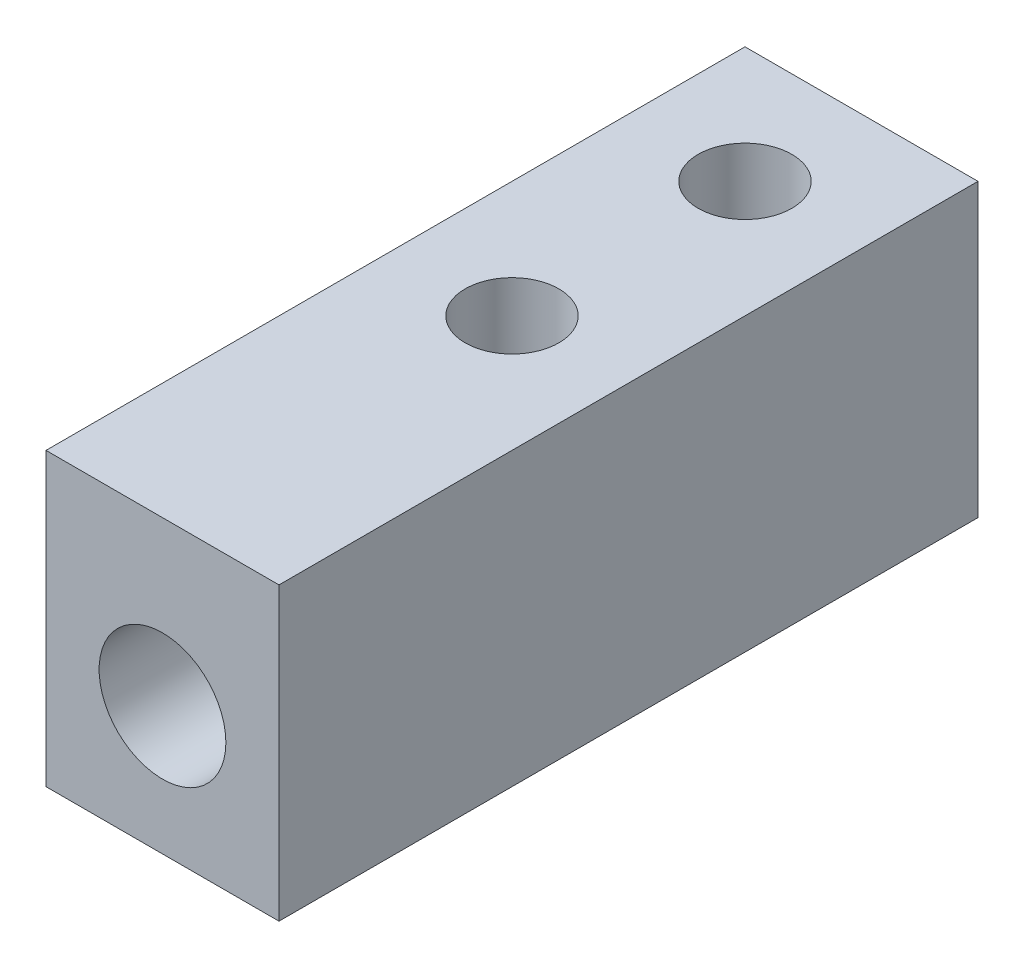
ISO-10303-21;
HEADER;
FILE_DESCRIPTION(('STEP AP214'),'2;1');
FILE_NAME('part.step','',(''),(''),'','','');
FILE_SCHEMA(('AUTOMOTIVE_DESIGN { 1 0 10303 214 1 1 1 1 }'));
ENDSEC;
DATA;
#1=APPLICATION_CONTEXT('core data for automotive mechanical design processes');
#2=APPLICATION_PROTOCOL_DEFINITION('international standard','automotive_design',2000,#1);
#3=PRODUCT_CONTEXT('',#1,'mechanical');
#4=PRODUCT('Part','Part','',(#3));
#5=PRODUCT_RELATED_PRODUCT_CATEGORY('part','',(#4));
#6=PRODUCT_DEFINITION_FORMATION('','',#4);
#7=PRODUCT_DEFINITION_CONTEXT('part definition',#1,'design');
#8=PRODUCT_DEFINITION('design','',#6,#7);
#9=PRODUCT_DEFINITION_SHAPE('','',#8);
#10=(LENGTH_UNIT() NAMED_UNIT(*) SI_UNIT(.MILLI.,.METRE.));
#11=(NAMED_UNIT(*) PLANE_ANGLE_UNIT() SI_UNIT($,.RADIAN.));
#12=(NAMED_UNIT(*) SI_UNIT($,.STERADIAN.) SOLID_ANGLE_UNIT());
#13=UNCERTAINTY_MEASURE_WITH_UNIT(LENGTH_MEASURE(1.E-05),#10,'distance_accuracy_value','');
#14=(GEOMETRIC_REPRESENTATION_CONTEXT(3) GLOBAL_UNCERTAINTY_ASSIGNED_CONTEXT((#13)) GLOBAL_UNIT_ASSIGNED_CONTEXT((#10,
#11,#12)) REPRESENTATION_CONTEXT('',''));
#15=CARTESIAN_POINT('',(0.,0.,0.));
#16=DIRECTION('',(0.,0.,1.));
#17=DIRECTION('',(1.,0.,0.));
#18=AXIS2_PLACEMENT_3D('',#15,#16,#17);
#19=CARTESIAN_POINT('',(6.35,-6.35,15.875));
#20=DIRECTION('',(-1.,0.,0.));
#21=DIRECTION('',(0.,0.,1.));
#22=AXIS2_PLACEMENT_3D('',#19,#20,#21);
#23=PLANE('',#22);
#24=DIRECTION('',(0.,1.,0.));
#25=VECTOR('',#24,1.);
#26=CARTESIAN_POINT('',(6.35,-6.35,-15.875));
#27=LINE('',#26,#25);
#28=CARTESIAN_POINT('',(6.35,-9.525,-15.875));
#29=VERTEX_POINT('',#28);
#30=CARTESIAN_POINT('',(6.35,6.35,-15.875));
#31=VERTEX_POINT('',#30);
#32=EDGE_CURVE('E109',#29,#31,#27,.T.);
#33=ORIENTED_EDGE('',*,*,#32,.T.);
#34=DIRECTION('',(0.,0.,-1.));
#35=VECTOR('',#34,1.);
#36=CARTESIAN_POINT('',(6.35,6.35,15.875));
#37=LINE('',#36,#35);
#38=CARTESIAN_POINT('',(6.35,6.35,22.225));
#39=VERTEX_POINT('',#38);
#40=EDGE_CURVE('E152',#39,#31,#37,.T.);
#41=ORIENTED_EDGE('',*,*,#40,.F.);
#42=DIRECTION('',(0.,1.,0.));
#43=VECTOR('',#42,1.);
#44=CARTESIAN_POINT('',(6.35,-6.35,22.225));
#45=LINE('',#44,#43);
#46=CARTESIAN_POINT('',(6.35,-9.525,22.225));
#47=VERTEX_POINT('',#46);
#48=EDGE_CURVE('E137',#47,#39,#45,.T.);
#49=ORIENTED_EDGE('',*,*,#48,.F.);
#50=DIRECTION('',(0.,0.,1.));
#51=VECTOR('',#50,1.);
#52=CARTESIAN_POINT('',(6.35,-9.525,0.));
#53=LINE('',#52,#51);
#54=EDGE_CURVE('E113',#29,#47,#53,.T.);
#55=ORIENTED_EDGE('',*,*,#54,.F.);
#56=EDGE_LOOP('',(#33,#41,#49,#55));
#57=FACE_BOUND('',#56,.T.);
#58=ADVANCED_FACE('F38',(#57),#23,.F.);
#59=CARTESIAN_POINT('',(-6.35,6.35,15.875));
#60=DIRECTION('',(0.,-1.,0.));
#61=DIRECTION('',(0.,0.,-1.));
#62=AXIS2_PLACEMENT_3D('',#59,#60,#61);
#63=PLANE('',#62);
#64=CARTESIAN_POINT('',(0.,6.35,-9.525));
#65=DIRECTION('',(0.,1.,0.));
#66=DIRECTION('',(0.,0.,1.));
#67=AXIS2_PLACEMENT_3D('',#64,#65,#66);
#68=CIRCLE('',#67,2.5527);
#69=CARTESIAN_POINT('',(0.,6.35,-6.9723));
#70=VERTEX_POINT('',#69);
#71=EDGE_CURVE('E143',#70,#70,#68,.T.);
#72=ORIENTED_EDGE('',*,*,#71,.F.);
#73=EDGE_LOOP('',(#72));
#74=FACE_BOUND('',#73,.T.);
#75=CARTESIAN_POINT('',(0.,6.35,3.175));
#76=DIRECTION('',(0.,1.,0.));
#77=DIRECTION('',(0.,0.,1.));
#78=AXIS2_PLACEMENT_3D('',#75,#76,#77);
#79=CIRCLE('',#78,2.5527);
#80=CARTESIAN_POINT('',(0.,6.35,5.7277));
#81=VERTEX_POINT('',#80);
#82=EDGE_CURVE('E146',#81,#81,#79,.T.);
#83=ORIENTED_EDGE('',*,*,#82,.F.);
#84=EDGE_LOOP('',(#83));
#85=FACE_BOUND('',#84,.T.);
#86=DIRECTION('',(-1.,0.,0.));
#87=VECTOR('',#86,1.);
#88=CARTESIAN_POINT('',(-6.35,6.35,-15.875));
#89=LINE('',#88,#87);
#90=CARTESIAN_POINT('',(-6.35,6.35,-15.875));
#91=VERTEX_POINT('',#90);
#92=EDGE_CURVE('E65',#31,#91,#89,.T.);
#93=ORIENTED_EDGE('',*,*,#92,.T.);
#94=DIRECTION('',(0.,0.,-1.));
#95=VECTOR('',#94,1.);
#96=CARTESIAN_POINT('',(-6.35,6.35,15.875));
#97=LINE('',#96,#95);
#98=CARTESIAN_POINT('',(-6.35,6.35,22.225));
#99=VERTEX_POINT('',#98);
#100=EDGE_CURVE('E102',#99,#91,#97,.T.);
#101=ORIENTED_EDGE('',*,*,#100,.F.);
#102=DIRECTION('',(-1.,0.,0.));
#103=VECTOR('',#102,1.);
#104=CARTESIAN_POINT('',(6.35,6.35,22.225));
#105=LINE('',#104,#103);
#106=EDGE_CURVE('E140',#39,#99,#105,.T.);
#107=ORIENTED_EDGE('',*,*,#106,.F.);
#108=ORIENTED_EDGE('',*,*,#40,.T.);
#109=EDGE_LOOP('',(#93,#101,#107,#108));
#110=FACE_BOUND('',#109,.T.);
#111=ADVANCED_FACE('F193',(#74,#85,#110),#63,.F.);
#112=CARTESIAN_POINT('',(-6.35,-6.35,15.875));
#113=DIRECTION('',(1.,0.,0.));
#114=DIRECTION('',(0.,0.,-1.));
#115=AXIS2_PLACEMENT_3D('',#112,#113,#114);
#116=PLANE('',#115);
#117=DIRECTION('',(0.,-1.,0.));
#118=VECTOR('',#117,1.);
#119=CARTESIAN_POINT('',(-6.35,-6.35,-15.875));
#120=LINE('',#119,#118);
#121=CARTESIAN_POINT('',(-6.35,-9.525,-15.875));
#122=VERTEX_POINT('',#121);
#123=EDGE_CURVE('E96',#91,#122,#120,.T.);
#124=ORIENTED_EDGE('',*,*,#123,.T.);
#125=DIRECTION('',(0.,0.,-1.));
#126=VECTOR('',#125,1.);
#127=CARTESIAN_POINT('',(-6.35,-9.525,0.));
#128=LINE('',#127,#126);
#129=CARTESIAN_POINT('',(-6.35,-9.525,22.225));
#130=VERTEX_POINT('',#129);
#131=EDGE_CURVE('E101',#130,#122,#128,.T.);
#132=ORIENTED_EDGE('',*,*,#131,.F.);
#133=DIRECTION('',(0.,-1.,0.));
#134=VECTOR('',#133,1.);
#135=CARTESIAN_POINT('',(-6.35,6.35,22.225));
#136=LINE('',#135,#134);
#137=EDGE_CURVE('E135',#99,#130,#136,.T.);
#138=ORIENTED_EDGE('',*,*,#137,.F.);
#139=ORIENTED_EDGE('',*,*,#100,.T.);
#140=EDGE_LOOP('',(#124,#132,#138,#139));
#141=FACE_BOUND('',#140,.T.);
#142=ADVANCED_FACE('F98',(#141),#116,.F.);
#143=CARTESIAN_POINT('',(0.,0.,-15.875));
#144=DIRECTION('',(0.,0.,-1.));
#145=DIRECTION('',(-1.,0.,0.));
#146=AXIS2_PLACEMENT_3D('',#143,#144,#145);
#147=PLANE('',#146);
#148=ORIENTED_EDGE('',*,*,#32,.F.);
#149=DIRECTION('',(1.,0.,0.));
#150=VECTOR('',#149,1.);
#151=CARTESIAN_POINT('',(0.,-9.525,-15.875));
#152=LINE('',#151,#150);
#153=EDGE_CURVE('E106',#122,#29,#152,.T.);
#154=ORIENTED_EDGE('',*,*,#153,.F.);
#155=ORIENTED_EDGE('',*,*,#123,.F.);
#156=ORIENTED_EDGE('',*,*,#92,.F.);
#157=EDGE_LOOP('',(#148,#154,#155,#156));
#158=FACE_BOUND('',#157,.T.);
#159=ADVANCED_FACE('F107',(#158),#147,.T.);
#160=CARTESIAN_POINT('',(0.,6.35,3.175));
#161=DIRECTION('',(0.,1.,0.));
#162=DIRECTION('',(0.,0.,1.));
#163=AXIS2_PLACEMENT_3D('',#160,#161,#162);
#164=CYLINDRICAL_SURFACE('',#163,2.5527);
#165=CARTESIAN_POINT('',(2.54003174980156,-0.198821222119082,2.921));
#166=CARTESIAN_POINT('',(2.5455625853347,-0.204841597343562,2.97614975832593));
#167=CARTESIAN_POINT('',(2.54928757178987,-0.208906837931241,3.03169681348345));
#168=CARTESIAN_POINT('',(2.55310257193398,-0.213075104677868,3.14302051223073));
#169=CARTESIAN_POINT('',(2.55319537632961,-0.213181172776462,3.19879694662559));
#170=CARTESIAN_POINT('',(2.54975338461195,-0.209412730397794,3.30939120843586));
#171=CARTESIAN_POINT('',(2.54626482404863,-0.20558895366113,3.36421219109609));
#172=CARTESIAN_POINT('',(2.53582266128414,-0.19425034062393,3.47312337297772));
#173=CARTESIAN_POINT('',(2.52886880762521,-0.186735236464103,3.52721351887361));
#174=CARTESIAN_POINT('',(2.50306101344616,-0.159200113671352,3.68746250110295));
#175=CARTESIAN_POINT('',(2.47924635965462,-0.134172003411395,3.7920122756807));
#176=CARTESIAN_POINT('',(2.41975614279613,-0.0743506229336212,3.9949582126047));
#177=CARTESIAN_POINT('',(2.38403538970131,-0.0395202274108101,4.093329206232));
#178=CARTESIAN_POINT('',(2.28275696108471,0.053951024187841,4.32754329527399));
#179=CARTESIAN_POINT('',(2.21106210902328,0.116099670642394,4.4593354803568));
#180=CARTESIAN_POINT('',(2.04709592464268,0.24445248458999,4.70725810537195));
#181=CARTESIAN_POINT('',(1.95479301216944,0.310662762039741,4.82336406439669));
#182=CARTESIAN_POINT('',(1.74878966964649,0.441575061297299,5.04069210683705));
#183=CARTESIAN_POINT('',(1.63473603531905,0.506228921579855,5.14161081622749));
#184=CARTESIAN_POINT('',(1.38747601552294,0.626479995762484,5.32316061029803));
#185=CARTESIAN_POINT('',(1.25431320805017,0.682097218310939,5.40383673734437));
#186=CARTESIAN_POINT('',(1.00511398292486,0.766897889821717,5.5245382008819));
#187=CARTESIAN_POINT('',(0.892621030944012,0.799221977570072,5.56967209736764));
#188=CARTESIAN_POINT('',(0.659953608120996,0.852867555724484,5.64392957175976));
#189=CARTESIAN_POINT('',(0.539784527841276,0.874196673924997,5.67306425009231));
#190=CARTESIAN_POINT('',(0.294317243326912,0.904067822335459,5.71373866831017));
#191=CARTESIAN_POINT('',(0.168997744872952,0.912549794915602,5.72519577399015));
#192=CARTESIAN_POINT('',(-0.0821328787922781,0.915704104444476,5.72946519982048));
#193=CARTESIAN_POINT('',(-0.20794393597688,0.910378289062203,5.72228001456169));
#194=CARTESIAN_POINT('',(-0.446515396690068,0.887359929626134,5.69100709419215));
#195=CARTESIAN_POINT('',(-0.559546661104451,0.870625414981295,5.66822824140625));
#196=CARTESIAN_POINT('',(-0.779704810285273,0.827126641648748,5.60838465800173));
#197=CARTESIAN_POINT('',(-0.886830426718521,0.800360238002718,5.5713168721608));
#198=CARTESIAN_POINT('',(-1.09985498204195,0.7366366150173,5.48168676492626));
#199=CARTESIAN_POINT('',(-1.2052324064628,0.699134913441538,5.42828159487252));
#200=CARTESIAN_POINT('',(-1.40571710993025,0.617306290888452,5.3089785751764));
#201=CARTESIAN_POINT('',(-1.50081966809931,0.572976255071992,5.24307502103518));
#202=CARTESIAN_POINT('',(-1.69605835701729,0.471712300935366,5.08756590511043));
#203=CARTESIAN_POINT('',(-1.79406035979648,0.413941316277447,4.99582935623974));
#204=CARTESIAN_POINT('',(-1.97425616795579,0.296681104754047,4.79871702467857));
#205=CARTESIAN_POINT('',(-2.05642944036682,0.23718975970987,4.69332381897044));
#206=CARTESIAN_POINT('',(-2.20122352925814,0.123758927569576,4.47403767303751));
#207=CARTESIAN_POINT('',(-2.26447497018634,0.0696939002654779,4.36062775992261));
#208=CARTESIAN_POINT('',(-2.37401690435931,-0.0295463850354151,4.12232854141586));
#209=CARTESIAN_POINT('',(-2.42034393554297,-0.07474069507892,3.99746470224325));
#210=CARTESIAN_POINT('',(-2.48404435583677,-0.139186540503882,3.77145321883195));
#211=CARTESIAN_POINT('',(-2.50581852716002,-0.162130323029662,3.67261911191682));
#212=CARTESIAN_POINT('',(-2.5375029166087,-0.195960515274457,3.47111778164637));
#213=CARTESIAN_POINT('',(-2.5474407762172,-0.206875012659059,3.36846006861597));
#214=CARTESIAN_POINT('',(-2.55313823751277,-0.213121471507567,3.2079418518863));
#215=CARTESIAN_POINT('',(-2.55322608395244,-0.213211865101632,3.15036183519643));
#216=CARTESIAN_POINT('',(-2.54953111151657,-0.209172179753339,3.03538774188973));
#217=CARTESIAN_POINT('',(-2.54574252311991,-0.205035809887572,2.97799407034497));
#218=CARTESIAN_POINT('',(-2.54003174980156,-0.198821222119082,2.921));
#219=B_SPLINE_CURVE_WITH_KNOTS('',3,(#165,#166,#167,#168,#169,#170,#171,#172,#173,#174,#175,
#176,#177,#178,#179,#180,#181,#182,#183,#184,#185,#186,#187,#188,#189,#190,#191,#192,#193,#194,
#195,#196,#197,#198,#199,#200,#201,#202,#203,#204,#205,#206,#207,#208,#209,#210,#211,#212,#213,
#214,#215,#216,#217,#218),.UNSPECIFIED.,.F.,.F.,(4,2,2,2,2,2,2,2,2,2,2,2,2,2,2,2,2,2,2,2,2,2,2,
2,2,2,4),(0.,0.167197730379011,0.334266995558834,0.499206186136148,0.664157347210234,
0.992838643583616,1.32278194378501,1.80739362477801,2.29275309348898,2.78679415254588,
3.27972595787044,3.65452684266316,4.02906735704547,4.40535342130878,4.78158913600044,
5.12959096776789,5.47766724968702,5.84811855568882,6.21873935137856,6.65554721171277,
7.09291793706871,7.51346125663709,7.93309122783032,8.24322192240428,8.55262693595834,
8.72510524895882,8.8978406453095),.UNSPECIFIED.);
#220=CARTESIAN_POINT('',(2.54003174980156,-0.198821222119084,2.921));
#221=VERTEX_POINT('',#220);
#222=CARTESIAN_POINT('',(-2.54003174980156,-0.198821222119084,2.921));
#223=VERTEX_POINT('',#222);
#224=EDGE_CURVE('E51',#221,#223,#219,.T.);
#225=ORIENTED_EDGE('',*,*,#224,.T.);
#226=CARTESIAN_POINT('',(-2.27826811024587,2.78664473271479,4.32642160299201));
#227=CARTESIAN_POINT('',(-2.30381166283261,2.68419463079826,4.27586204458835));
#228=CARTESIAN_POINT('',(-2.32731195412034,2.5813034057985,4.22520167031956));
#229=CARTESIAN_POINT('',(-2.37046386364825,2.37477427232625,4.12380096272925));
#230=CARTESIAN_POINT('',(-2.39011605729266,2.27113647789446,4.07306064250758));
#231=CARTESIAN_POINT('',(-2.44364499673536,1.95939226329195,3.92094383798124));
#232=CARTESIAN_POINT('',(-2.47212590225548,1.75032468984307,3.81960705661596));
#233=CARTESIAN_POINT('',(-2.5159723266247,1.33125876777479,3.61850392491961));
#234=CARTESIAN_POINT('',(-2.53139502888604,1.12126856795188,3.51873262514282));
#235=CARTESIAN_POINT('',(-2.55041267530066,0.699661391262236,3.32151182022407));
#236=CARTESIAN_POINT('',(-2.55400721637147,0.488044359202307,3.22406239431974));
#237=CARTESIAN_POINT('',(-2.55107351934236,0.126826954401827,3.06208078420683));
#238=CARTESIAN_POINT('',(-2.54726113560248,-0.0223122355226503,2.99645199996785));
#239=CARTESIAN_POINT('',(-2.53503543345821,-0.32179435847212,2.86839776558355));
#240=CARTESIAN_POINT('',(-2.52662166772916,-0.472137407130162,2.80597262752711));
#241=CARTESIAN_POINT('',(-2.50615760335433,-0.774812060914608,2.68598197399423));
#242=CARTESIAN_POINT('',(-2.49410144831818,-0.927146487652279,2.62842447710787));
#243=CARTESIAN_POINT('',(-2.47469938412529,-1.15765716406798,2.5481766408735));
#244=CARTESIAN_POINT('',(-2.46801350995833,-1.23481698465687,2.5224455543879));
#245=CARTESIAN_POINT('',(-2.45458243395389,-1.38995776461611,2.4736126670088));
#246=CARTESIAN_POINT('',(-2.44783721139027,-1.46793901289276,2.45051182739853));
#247=CARTESIAN_POINT('',(-2.42478036878117,-1.74440483834552,2.3750751845181));
#248=CARTESIAN_POINT('',(-2.4095135691971,-1.94586973804128,2.33168034602676));
#249=CARTESIAN_POINT('',(-2.39598559151766,-2.25108000932045,2.29424745502158));
#250=CARTESIAN_POINT('',(-2.39303108480873,-2.35286757296697,2.28635480477719));
#251=CARTESIAN_POINT('',(-2.39093796080821,-2.55675008070855,2.28074044966988));
#252=CARTESIAN_POINT('',(-2.39179813187694,-2.65884491691121,2.2830155152809));
#253=CARTESIAN_POINT('',(-2.39782291622705,-2.88921861796298,2.29931813280139));
#254=CARTESIAN_POINT('',(-2.40406978367599,-3.01725222620705,2.31630576001454));
#255=CARTESIAN_POINT('',(-2.42010815252713,-3.27088059608881,2.3626417861657));
#256=CARTESIAN_POINT('',(-2.42990543868823,-3.39647102309918,2.39201037043952));
#257=CARTESIAN_POINT('',(-2.45069040638404,-3.64679835912364,2.45969273075921));
#258=CARTESIAN_POINT('',(-2.4616919070997,-3.77150294857926,2.49811782910515));
#259=CARTESIAN_POINT('',(-2.48294093691934,-4.01891995016431,2.58077430950593));
#260=CARTESIAN_POINT('',(-2.49318890067682,-4.14163347842515,2.62500230269456));
#261=CARTESIAN_POINT('',(-2.50954371526585,-4.35617424760997,2.7062235472012));
#262=CARTESIAN_POINT('',(-2.51605262211851,-4.44829175921498,2.74237862323179));
#263=CARTESIAN_POINT('',(-2.52766529943717,-4.63192319279191,2.81640794684024));
#264=CARTESIAN_POINT('',(-2.53276905574667,-4.72343710867371,2.85428221173397));
#265=CARTESIAN_POINT('',(-2.5413061184775,-4.90525572189286,2.93103171247331));
#266=CARTESIAN_POINT('',(-2.54475249808377,-4.99556423022556,2.96989647993546));
#267=CARTESIAN_POINT('',(-2.54987561996407,-5.17581098208615,3.04863180064891));
#268=CARTESIAN_POINT('',(-2.55155202856463,-5.2657491526161,3.08850254209555));
#269=CARTESIAN_POINT('',(-2.55337991995479,-5.49080001360609,3.18942483097329));
#270=CARTESIAN_POINT('',(-2.55232785863186,-5.62570498032203,3.25096937063293));
#271=CARTESIAN_POINT('',(-2.54559390919191,-5.89483976960276,3.37526026773121));
#272=CARTESIAN_POINT('',(-2.53991176801219,-6.02906955486119,3.43800669067721));
#273=CARTESIAN_POINT('',(-2.51551404182126,-6.43073969084947,3.62742551683001));
#274=CARTESIAN_POINT('',(-2.48944810508937,-6.69723768169266,3.75531246430984));
#275=CARTESIAN_POINT('',(-2.43342607698866,-7.09724958622701,3.94919225904405));
#276=CARTESIAN_POINT('',(-2.41159948634243,-7.23209219532304,4.01488311529596));
#277=CARTESIAN_POINT('',(-2.36175727398909,-7.50063094956784,4.14624206101717));
#278=CARTESIAN_POINT('',(-2.33374254716882,-7.63432725758585,4.21191015240471));
#279=CARTESIAN_POINT('',(-2.2709496580309,-7.90050167584972,4.34306579433928));
#280=CARTESIAN_POINT('',(-2.23616093867952,-8.03297754213814,4.40855289913769));
#281=CARTESIAN_POINT('',(-2.15906979365662,-8.29609230053211,4.5389566604418));
#282=CARTESIAN_POINT('',(-2.11676350027126,-8.42673020951179,4.60387300516802));
#283=CARTESIAN_POINT('',(-2.07032655963891,-8.55617773925496,4.66832689872436));
#284=B_SPLINE_CURVE_WITH_KNOTS('',3,(#226,#227,#228,#229,#230,#231,#232,#233,#234,#235,#236,
#237,#238,#239,#240,#241,#242,#243,#244,#245,#246,#247,#248,#249,#250,#251,#252,#253,#254,#255,
#256,#257,#258,#259,#260,#261,#262,#263,#264,#265,#266,#267,#268,#269,#270,#271,#272,#273,#274,
#275,#276,#277,#278,#279,#280,#281,#282,#283),.UNSPECIFIED.,.F.,.F.,(4,2,2,2,2,2,2,2,2,2,2,2,2,
2,2,2,2,2,2,2,2,2,2,2,2,2,2,2,4),(0.,0.351156200321306,0.702259852256159,1.40402151373051,
2.10269394553881,2.80139018660074,3.29025568022524,3.77916870749938,4.2688720519386,
4.51364913508764,4.75851539233992,5.3756137792634,5.68150057537438,5.98729022093841,
6.37427166135354,6.76188647325326,7.15454018758621,7.54696560605718,7.84445690594884,
8.14195120287477,8.4370587617162,8.73222194406312,9.17698595394922,9.62177427458863,
10.5110980068797,10.9657149174938,11.4202661274442,11.8755314930492,12.331031769743),.UNSPECIFIED.);
#285=CARTESIAN_POINT('',(-2.54003174980156,-4.88117877788092,2.921));
#286=VERTEX_POINT('',#285);
#287=EDGE_CURVE('E11',#223,#286,#284,.T.);
#288=ORIENTED_EDGE('',*,*,#287,.T.);
#289=CARTESIAN_POINT('',(-2.54003174980156,-4.88117877788092,2.921));
#290=CARTESIAN_POINT('',(-2.5455625853347,-4.87515840265644,2.97614975832593));
#291=CARTESIAN_POINT('',(-2.54928757178987,-4.87109316206876,3.03169681348345));
#292=CARTESIAN_POINT('',(-2.55310257193398,-4.86692489532213,3.14302051223073));
#293=CARTESIAN_POINT('',(-2.55319537632961,-4.86681882722354,3.19879694662559));
#294=CARTESIAN_POINT('',(-2.54975338461195,-4.87058726960221,3.30939120843586));
#295=CARTESIAN_POINT('',(-2.54626482404863,-4.87441104633887,3.36421219109609));
#296=CARTESIAN_POINT('',(-2.53582266128414,-4.88574965937607,3.47312337297772));
#297=CARTESIAN_POINT('',(-2.52886880762521,-4.8932647635359,3.52721351887361));
#298=CARTESIAN_POINT('',(-2.50306101344616,-4.92079988632865,3.68746250110295));
#299=CARTESIAN_POINT('',(-2.47924635965462,-4.94582799658861,3.7920122756807));
#300=CARTESIAN_POINT('',(-2.41975614279613,-5.00564937706638,3.9949582126047));
#301=CARTESIAN_POINT('',(-2.38403538970131,-5.04047977258919,4.093329206232));
#302=CARTESIAN_POINT('',(-2.28275696108471,-5.13395102418784,4.32754329527399));
#303=CARTESIAN_POINT('',(-2.21106210902328,-5.19609967064239,4.45933548035681));
#304=CARTESIAN_POINT('',(-2.04709592464268,-5.32445248458999,4.70725810537195));
#305=CARTESIAN_POINT('',(-1.95479301216944,-5.39066276203974,4.82336406439669));
#306=CARTESIAN_POINT('',(-1.74878966964648,-5.5215750612973,5.04069210683705));
#307=CARTESIAN_POINT('',(-1.63473603531905,-5.58622892157986,5.14161081622749));
#308=CARTESIAN_POINT('',(-1.38747601552294,-5.70647999576248,5.32316061029803));
#309=CARTESIAN_POINT('',(-1.25431320805017,-5.76209721831094,5.40383673734437));
#310=CARTESIAN_POINT('',(-1.00511398292486,-5.84689788982172,5.5245382008819));
#311=CARTESIAN_POINT('',(-0.892621030944013,-5.87922197757007,5.56967209736764));
#312=CARTESIAN_POINT('',(-0.659953608120997,-5.93286755572448,5.64392957175976));
#313=CARTESIAN_POINT('',(-0.539784527841276,-5.954196673925,5.67306425009231));
#314=CARTESIAN_POINT('',(-0.294317243326912,-5.98406782233546,5.71373866831017));
#315=CARTESIAN_POINT('',(-0.168997744872953,-5.9925497949156,5.72519577399015));
#316=CARTESIAN_POINT('',(0.0821328787922781,-5.99570410444448,5.72946519982048));
#317=CARTESIAN_POINT('',(0.20794393597688,-5.9903782890622,5.72228001456169));
#318=CARTESIAN_POINT('',(0.446515396690068,-5.96735992962613,5.69100709419215));
#319=CARTESIAN_POINT('',(0.559546661104451,-5.9506254149813,5.66822824140625));
#320=CARTESIAN_POINT('',(0.779704810285273,-5.90712664164875,5.60838465800173));
#321=CARTESIAN_POINT('',(0.88683042671852,-5.88036023800272,5.5713168721608));
#322=CARTESIAN_POINT('',(1.09985498204195,-5.8166366150173,5.48168676492626));
#323=CARTESIAN_POINT('',(1.2052324064628,-5.77913491344154,5.42828159487252));
#324=CARTESIAN_POINT('',(1.40571710993025,-5.69730629088845,5.3089785751764));
#325=CARTESIAN_POINT('',(1.50081966809931,-5.65297625507199,5.24307502103518));
#326=CARTESIAN_POINT('',(1.69605835701729,-5.55171230093537,5.08756590511043));
#327=CARTESIAN_POINT('',(1.79406035979648,-5.49394131627745,4.99582935623974));
#328=CARTESIAN_POINT('',(1.97425616795579,-5.37668110475405,4.79871702467857));
#329=CARTESIAN_POINT('',(2.05642944036682,-5.31718975970987,4.69332381897044));
#330=CARTESIAN_POINT('',(2.20122352925814,-5.20375892756958,4.47403767303751));
#331=CARTESIAN_POINT('',(2.26447497018634,-5.14969390026548,4.36062775992261));
#332=CARTESIAN_POINT('',(2.37401690435931,-5.05045361496459,4.12232854141586));
#333=CARTESIAN_POINT('',(2.42034393554297,-5.00525930492108,3.99746470224325));
#334=CARTESIAN_POINT('',(2.48404435583677,-4.94081345949612,3.77145321883195));
#335=CARTESIAN_POINT('',(2.50581852716002,-4.91786967697034,3.67261911191682));
#336=CARTESIAN_POINT('',(2.5375029166087,-4.88403948472554,3.47111778164637));
#337=CARTESIAN_POINT('',(2.5474407762172,-4.87312498734094,3.36846006861597));
#338=CARTESIAN_POINT('',(2.55313823751277,-4.86687852849243,3.2079418518863));
#339=CARTESIAN_POINT('',(2.55322608395244,-4.86678813489837,3.15036183519643));
#340=CARTESIAN_POINT('',(2.54953111151657,-4.87082782024666,3.03538774188973));
#341=CARTESIAN_POINT('',(2.54574252311991,-4.87496419011243,2.97799407034497));
#342=CARTESIAN_POINT('',(2.54003174980156,-4.88117877788092,2.921));
#343=B_SPLINE_CURVE_WITH_KNOTS('',3,(#289,#290,#291,#292,#293,#294,#295,#296,#297,#298,#299,
#300,#301,#302,#303,#304,#305,#306,#307,#308,#309,#310,#311,#312,#313,#314,#315,#316,#317,#318,
#319,#320,#321,#322,#323,#324,#325,#326,#327,#328,#329,#330,#331,#332,#333,#334,#335,#336,#337,
#338,#339,#340,#341,#342),.UNSPECIFIED.,.F.,.F.,(4,2,2,2,2,2,2,2,2,2,2,2,2,2,2,2,2,2,2,2,2,2,2,
2,2,2,4),(0.,0.167197730379011,0.334266995558834,0.499206186136148,0.664157347210235,
0.992838643583615,1.32278194378501,1.80739362477801,2.29275309348898,2.78679415254588,
3.27972595787044,3.65452684266316,4.02906735704547,4.40535342130878,4.78158913600044,
5.12959096776789,5.47766724968702,5.84811855568882,6.21873935137856,6.65554721171277,
7.09291793706871,7.51346125663709,7.93309122783032,8.24322192240428,8.55262693595834,
8.72510524895882,8.8978406453095),.UNSPECIFIED.);
#344=CARTESIAN_POINT('',(2.54003174980156,-4.88117877788092,2.921));
#345=VERTEX_POINT('',#344);
#346=EDGE_CURVE('E161',#286,#345,#343,.T.);
#347=ORIENTED_EDGE('',*,*,#346,.T.);
#348=CARTESIAN_POINT('',(2.07032655963891,-8.55617773925496,4.66832689872436));
#349=CARTESIAN_POINT('',(2.1117060665355,-8.44086529236991,4.61091037254973));
#350=CARTESIAN_POINT('',(2.14979490360026,-8.32459736596763,4.55312235238867));
#351=CARTESIAN_POINT('',(2.21993560276446,-8.09055036506694,4.43706029896668));
#352=CARTESIAN_POINT('',(2.25198988265257,-7.97277191605937,4.37878647016295));
#353=CARTESIAN_POINT('',(2.31060544861238,-7.73614258392963,4.26202845763028));
#354=CARTESIAN_POINT('',(2.33717282292758,-7.61729304383543,4.20354458110839));
#355=CARTESIAN_POINT('',(2.38526074570398,-7.37861214233959,4.08648901447491));
#356=CARTESIAN_POINT('',(2.40678072403274,-7.25878067160388,4.02791731519451));
#357=CARTESIAN_POINT('',(2.46408991069671,-6.89927089627768,3.85292006114403));
#358=CARTESIAN_POINT('',(2.49291248668795,-6.65839701397753,3.73662826352431));
#359=CARTESIAN_POINT('',(2.53385305246088,-6.17436956630084,3.50597320283198));
#360=CARTESIAN_POINT('',(2.54597170250251,-5.93121609141279,3.39160986370927));
#361=CARTESIAN_POINT('',(2.55160307451402,-5.63187954022124,3.25401798910696));
#362=CARTESIAN_POINT('',(2.55225675235616,-5.57669719105002,3.22878539718135));
#363=CARTESIAN_POINT('',(2.55282102444695,-5.46620579629612,3.17857358504587));
#364=CARTESIAN_POINT('',(2.55273154091204,-5.41089673805703,3.15359439163209));
#365=CARTESIAN_POINT('',(2.55107195213964,-5.20684205619851,3.06208193926677));
#366=CARTESIAN_POINT('',(2.54726094542262,-5.05769996854554,2.99645588933165));
#367=CARTESIAN_POINT('',(2.53503707449866,-4.75822899990507,2.86840908159908));
#368=CARTESIAN_POINT('',(2.52662398368891,-4.60790006083723,2.80598848180093));
#369=CARTESIAN_POINT('',(2.50616047149952,-4.30522720486589,2.68599653202887));
#370=CARTESIAN_POINT('',(2.49410361633493,-4.15288018335233,2.62843399180173));
#371=CARTESIAN_POINT('',(2.47470048538372,-3.92235545118601,2.5481809196308));
#372=CARTESIAN_POINT('',(2.46801446330415,-3.84519399067801,2.52244912603433));
#373=CARTESIAN_POINT('',(2.45458296849351,-3.69004844609028,2.47361450431734));
#374=CARTESIAN_POINT('',(2.44783747405193,-3.61206405936521,2.45051268304722));
#375=CARTESIAN_POINT('',(2.42478817814356,-3.3356889952481,2.3751007443097));
#376=CARTESIAN_POINT('',(2.40952797396537,-3.13432197867202,2.33172137638536));
#377=CARTESIAN_POINT('',(2.39599346912049,-2.82916310227006,2.29426862172991));
#378=CARTESIAN_POINT('',(2.39303486456203,-2.72732704751377,2.28636496257133));
#379=CARTESIAN_POINT('',(2.3909371808875,-2.52334719803368,2.28073834117526));
#380=CARTESIAN_POINT('',(2.39179686864197,-2.42120351330805,2.28301209211315));
#381=CARTESIAN_POINT('',(2.39782427016043,-2.19072944999727,2.29932180270562));
#382=CARTESIAN_POINT('',(2.40407486946734,-2.06264448463053,2.31631954099969));
#383=CARTESIAN_POINT('',(2.42012255774822,-1.80891506053866,2.36268427518315));
#384=CARTESIAN_POINT('',(2.42992545382687,-1.68327495496767,2.39207153773452));
#385=CARTESIAN_POINT('',(2.45071234556456,-1.43295055523808,2.45976824243251));
#386=CARTESIAN_POINT('',(2.4617092778213,-1.30829656356521,2.49818204136739));
#387=CARTESIAN_POINT('',(2.48294933300958,-1.06098049526433,2.58081033491484));
#388=CARTESIAN_POINT('',(2.49319289823459,-0.938317283377282,2.62502138290222));
#389=CARTESIAN_POINT('',(2.50954109098967,-0.723857750341016,2.70621110014587));
#390=CARTESIAN_POINT('',(2.51604754141549,-0.631771662202542,2.74235263254333));
#391=CARTESIAN_POINT('',(2.52765836651159,-0.448203341188222,2.81635735858471));
#392=CARTESIAN_POINT('',(2.53276269668442,-0.356721127566737,2.85422060682429));
#393=CARTESIAN_POINT('',(2.54555016959871,-0.0843110331231444,2.96919520869028));
#394=CARTESIAN_POINT('',(2.55081843680031,0.0959302348478951,3.04821751386784));
#395=CARTESIAN_POINT('',(2.55400275399278,0.486893698788159,3.22355602618853));
#396=CARTESIAN_POINT('',(2.55045301770779,0.697366429573843,3.32045826570889));
#397=CARTESIAN_POINT('',(2.53166279820877,1.11671227357258,3.51658176733812));
#398=CARTESIAN_POINT('',(2.51642223377175,1.32558537566189,3.61580304555407));
#399=CARTESIAN_POINT('',(2.47285584167761,1.74469944180996,3.81688631783952));
#400=CARTESIAN_POINT('',(2.44433338762094,1.954912443218,3.91876548848042));
#401=CARTESIAN_POINT('',(2.39063311212033,2.2683549597315,4.07169971828633));
#402=CARTESIAN_POINT('',(2.37090593844491,2.37255432185791,4.12271254783379));
#403=CARTESIAN_POINT('',(2.32756398621633,2.58019934645299,4.22465810582914));
#404=CARTESIAN_POINT('',(2.30394862131855,2.68364489278448,4.27559082102437));
#405=CARTESIAN_POINT('',(2.27826811024587,2.78664473271479,4.32642160299201));
#406=B_SPLINE_CURVE_WITH_KNOTS('',3,(#348,#349,#350,#351,#352,#353,#354,#355,#356,#357,#358,
#359,#360,#361,#362,#363,#364,#365,#366,#367,#368,#369,#370,#371,#372,#373,#374,#375,#376,#377,
#378,#379,#380,#381,#382,#383,#384,#385,#386,#387,#388,#389,#390,#391,#392,#393,#394,#395,#396,
#397,#398,#399,#400,#401,#402,#403,#404,#405),.UNSPECIFIED.,.F.,.F.,(4,2,2,2,2,2,2,2,2,2,2,2,2,
2,2,2,2,2,2,2,2,2,2,2,2,2,2,2,4),(0.,0.405803364955137,0.811443794236772,1.21663167959411,
1.62186531123799,2.4283008175894,3.23470444686479,3.4167456778564,3.59880596257454,
4.08765601682532,4.57653014381631,5.06627256847599,5.31105516847625,5.55593116736323,
6.17273741053841,6.47877141481299,6.78470659163547,7.17184406564574,7.55961728760465,
7.95211568131295,8.34438177299267,8.64176942582187,8.93916651540652,9.52960540563673,
10.2245131768817,10.9194257761,11.6249699618433,11.9779564845543,12.330996286958),.UNSPECIFIED.);
#407=EDGE_CURVE('E154',#345,#221,#406,.T.);
#408=ORIENTED_EDGE('',*,*,#407,.T.);
#409=EDGE_LOOP('',(#225,#288,#347,#408));
#410=FACE_BOUND('',#409,.T.);
#411=ORIENTED_EDGE('',*,*,#82,.T.);
#412=EDGE_LOOP('',(#411));
#413=FACE_BOUND('',#412,.T.);
#414=CARTESIAN_POINT('',(0.,-9.525,3.175));
#415=DIRECTION('',(0.,-1.,0.));
#416=DIRECTION('',(0.,0.,-1.));
#417=AXIS2_PLACEMENT_3D('',#414,#415,#416);
#418=CIRCLE('',#417,2.5527);
#419=CARTESIAN_POINT('',(0.,-9.525,0.622300000000001));
#420=VERTEX_POINT('',#419);
#421=EDGE_CURVE('E120',#420,#420,#418,.F.);
#422=ORIENTED_EDGE('',*,*,#421,.F.);
#423=EDGE_LOOP('',(#422));
#424=FACE_BOUND('',#423,.T.);
#425=ADVANCED_FACE('F167',(#410,#413,#424),#164,.F.);
#426=CARTESIAN_POINT('',(0.,6.35,-9.525));
#427=DIRECTION('',(0.,1.,0.));
#428=DIRECTION('',(0.,0.,1.));
#429=AXIS2_PLACEMENT_3D('',#426,#427,#428);
#430=CYLINDRICAL_SURFACE('',#429,2.5527);
#431=ORIENTED_EDGE('',*,*,#71,.T.);
#432=EDGE_LOOP('',(#431));
#433=FACE_BOUND('',#432,.T.);
#434=CARTESIAN_POINT('',(0.,-9.525,-9.525));
#435=DIRECTION('',(0.,-1.,0.));
#436=DIRECTION('',(0.,0.,-1.));
#437=AXIS2_PLACEMENT_3D('',#434,#435,#436);
#438=CIRCLE('',#437,2.5527);
#439=CARTESIAN_POINT('',(0.,-9.525,-12.0777));
#440=VERTEX_POINT('',#439);
#441=EDGE_CURVE('E127',#440,#440,#438,.F.);
#442=ORIENTED_EDGE('',*,*,#441,.F.);
#443=EDGE_LOOP('',(#442));
#444=FACE_BOUND('',#443,.T.);
#445=ADVANCED_FACE('F183',(#433,#444),#430,.F.);
#446=CARTESIAN_POINT('',(0.,0.,22.225));
#447=DIRECTION('',(0.,0.,1.));
#448=DIRECTION('',(1.,0.,0.));
#449=AXIS2_PLACEMENT_3D('',#446,#447,#448);
#450=PLANE('',#449);
#451=CARTESIAN_POINT('',(0.,-2.54,22.225));
#452=DIRECTION('',(0.,0.,1.));
#453=DIRECTION('',(1.,0.,0.));
#454=AXIS2_PLACEMENT_3D('',#451,#452,#453);
#455=CIRCLE('',#454,3.4544);
#456=CARTESIAN_POINT('',(3.4544,-2.54,22.225));
#457=VERTEX_POINT('',#456);
#458=EDGE_CURVE('E130',#457,#457,#455,.T.);
#459=ORIENTED_EDGE('',*,*,#458,.F.);
#460=EDGE_LOOP('',(#459));
#461=FACE_BOUND('',#460,.T.);
#462=ORIENTED_EDGE('',*,*,#137,.T.);
#463=DIRECTION('',(-1.,0.,0.));
#464=VECTOR('',#463,1.);
#465=CARTESIAN_POINT('',(0.,-9.525,22.225));
#466=LINE('',#465,#464);
#467=EDGE_CURVE('E119',#47,#130,#466,.T.);
#468=ORIENTED_EDGE('',*,*,#467,.F.);
#469=ORIENTED_EDGE('',*,*,#48,.T.);
#470=ORIENTED_EDGE('',*,*,#106,.T.);
#471=EDGE_LOOP('',(#462,#468,#469,#470));
#472=FACE_BOUND('',#471,.T.);
#473=ADVANCED_FACE('F180',(#461,#472),#450,.T.);
#474=CARTESIAN_POINT('',(0.,-2.54,22.225));
#475=DIRECTION('',(0.,0.,1.));
#476=DIRECTION('',(1.,0.,0.));
#477=AXIS2_PLACEMENT_3D('',#474,#475,#476);
#478=CYLINDRICAL_SURFACE('',#477,3.4544);
#479=ORIENTED_EDGE('',*,*,#458,.T.);
#480=EDGE_LOOP('',(#479));
#481=FACE_BOUND('',#480,.T.);
#482=CARTESIAN_POINT('',(0.,-2.54,2.921));
#483=DIRECTION('',(0.,0.,1.));
#484=DIRECTION('',(1.,0.,0.));
#485=AXIS2_PLACEMENT_3D('',#482,#483,#484);
#486=CIRCLE('',#485,3.4544);
#487=EDGE_CURVE('E57',#345,#221,#486,.T.);
#488=ORIENTED_EDGE('',*,*,#487,.F.);
#489=ORIENTED_EDGE('',*,*,#346,.F.);
#490=EDGE_CURVE('E134',#223,#286,#486,.T.);
#491=ORIENTED_EDGE('',*,*,#490,.F.);
#492=ORIENTED_EDGE('',*,*,#224,.F.);
#493=EDGE_LOOP('',(#488,#489,#491,#492));
#494=FACE_BOUND('',#493,.T.);
#495=ADVANCED_FACE('F176',(#481,#494),#478,.F.);
#496=CARTESIAN_POINT('',(0.,-2.54,2.921));
#497=DIRECTION('',(0.,0.,1.));
#498=DIRECTION('',(1.,0.,0.));
#499=AXIS2_PLACEMENT_3D('',#496,#497,#498);
#500=CONICAL_SURFACE('',#499,3.4544,1.02974425867665);
#501=ORIENTED_EDGE('',*,*,#490,.T.);
#502=ORIENTED_EDGE('',*,*,#287,.F.);
#503=EDGE_LOOP('',(#501,#502));
#504=FACE_BOUND('',#503,.T.);
#505=ADVANCED_FACE('F171',(#504),#500,.F.);
#506=ORIENTED_EDGE('',*,*,#487,.T.);
#507=ORIENTED_EDGE('',*,*,#407,.F.);
#508=EDGE_LOOP('',(#506,#507));
#509=FACE_BOUND('',#508,.T.);
#510=ADVANCED_FACE('F175',(#509),#500,.F.);
#511=CARTESIAN_POINT('',(0.,-9.525,0.));
#512=DIRECTION('',(0.,-1.,0.));
#513=DIRECTION('',(0.,0.,-1.));
#514=AXIS2_PLACEMENT_3D('',#511,#512,#513);
#515=PLANE('',#514);
#516=ORIENTED_EDGE('',*,*,#421,.T.);
#517=EDGE_LOOP('',(#516));
#518=FACE_BOUND('',#517,.T.);
#519=ORIENTED_EDGE('',*,*,#131,.T.);
#520=ORIENTED_EDGE('',*,*,#153,.T.);
#521=ORIENTED_EDGE('',*,*,#54,.T.);
#522=ORIENTED_EDGE('',*,*,#467,.T.);
#523=EDGE_LOOP('',(#519,#520,#521,#522));
#524=FACE_BOUND('',#523,.T.);
#525=ORIENTED_EDGE('',*,*,#441,.T.);
#526=EDGE_LOOP('',(#525));
#527=FACE_BOUND('',#526,.T.);
#528=ADVANCED_FACE('F116',(#518,#524,#527),#515,.T.);
#529=CLOSED_SHELL('',(#58,#111,#142,#159,#425,#445,#473,#495,#505,#510,#528));
#530=MANIFOLD_SOLID_BREP('B2',#529);
#531=ADVANCED_BREP_SHAPE_REPRESENTATION('',(#18,#530),#14);
#532=SHAPE_DEFINITION_REPRESENTATION(#9,#531);
ENDSEC;
END-ISO-10303-21;
